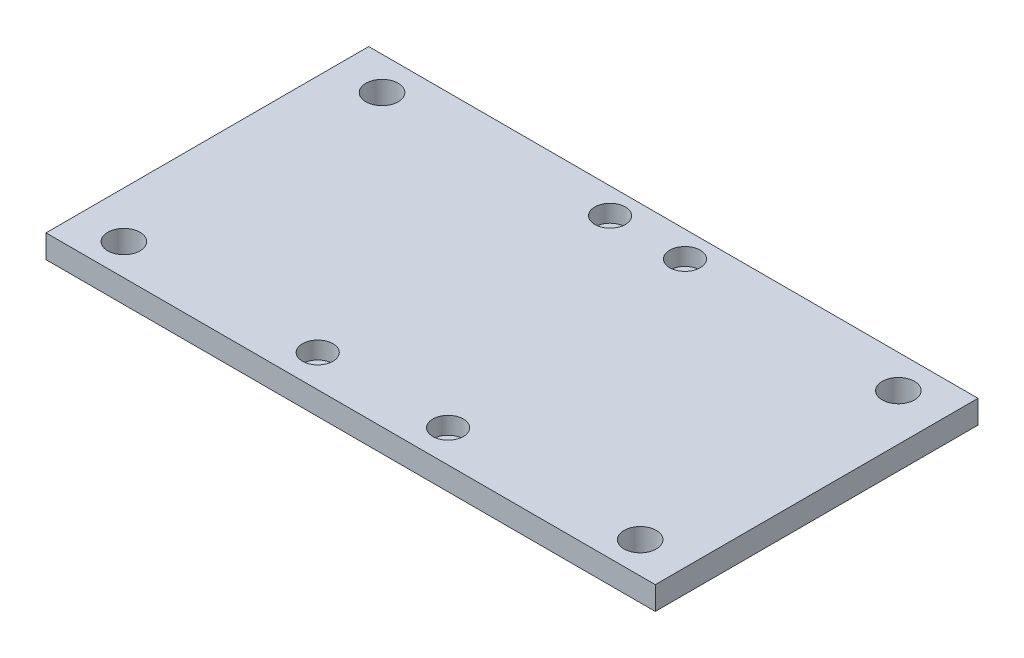
ISO-10303-21;
HEADER;
FILE_DESCRIPTION(('STEP AP214'),'2;1');
FILE_NAME('part.step','',(''),(''),'','','');
FILE_SCHEMA(('AUTOMOTIVE_DESIGN { 1 0 10303 214 1 1 1 1 }'));
ENDSEC;
DATA;
#1=APPLICATION_CONTEXT('core data for automotive mechanical design processes');
#2=APPLICATION_PROTOCOL_DEFINITION('international standard','automotive_design',2000,#1);
#3=PRODUCT_CONTEXT('',#1,'mechanical');
#4=PRODUCT('Part','Part','',(#3));
#5=PRODUCT_RELATED_PRODUCT_CATEGORY('part','',(#4));
#6=PRODUCT_DEFINITION_FORMATION('','',#4);
#7=PRODUCT_DEFINITION_CONTEXT('part definition',#1,'design');
#8=PRODUCT_DEFINITION('design','',#6,#7);
#9=PRODUCT_DEFINITION_SHAPE('','',#8);
#10=(LENGTH_UNIT() NAMED_UNIT(*) SI_UNIT(.MILLI.,.METRE.));
#11=(NAMED_UNIT(*) PLANE_ANGLE_UNIT() SI_UNIT($,.RADIAN.));
#12=(NAMED_UNIT(*) SI_UNIT($,.STERADIAN.) SOLID_ANGLE_UNIT());
#13=UNCERTAINTY_MEASURE_WITH_UNIT(LENGTH_MEASURE(1.E-05),#10,'distance_accuracy_value','');
#14=(GEOMETRIC_REPRESENTATION_CONTEXT(3) GLOBAL_UNCERTAINTY_ASSIGNED_CONTEXT((#13)) GLOBAL_UNIT_ASSIGNED_CONTEXT((#10,
#11,#12)) REPRESENTATION_CONTEXT('',''));
#15=CARTESIAN_POINT('',(0.,0.,0.));
#16=DIRECTION('',(0.,0.,1.));
#17=DIRECTION('',(1.,0.,0.));
#18=AXIS2_PLACEMENT_3D('',#15,#16,#17);
#19=CARTESIAN_POINT('',(-59.944,4.572,-31.75));
#20=DIRECTION('',(1.,0.,0.));
#21=DIRECTION('',(0.,0.,-1.));
#22=AXIS2_PLACEMENT_3D('',#19,#20,#21);
#23=PLANE('',#22);
#24=DIRECTION('',(0.,0.,1.));
#25=VECTOR('',#24,1.);
#26=CARTESIAN_POINT('',(-59.944,0.,-31.75));
#27=LINE('',#26,#25);
#28=CARTESIAN_POINT('',(-59.944,0.,-31.75));
#29=VERTEX_POINT('',#28);
#30=CARTESIAN_POINT('',(-59.944,0.,31.75));
#31=VERTEX_POINT('',#30);
#32=EDGE_CURVE('E107',#29,#31,#27,.T.);
#33=ORIENTED_EDGE('',*,*,#32,.T.);
#34=DIRECTION('',(0.,-1.,0.));
#35=VECTOR('',#34,1.);
#36=CARTESIAN_POINT('',(-59.944,4.572,31.75));
#37=LINE('',#36,#35);
#38=CARTESIAN_POINT('',(-59.944,4.572,31.75));
#39=VERTEX_POINT('',#38);
#40=EDGE_CURVE('E11',#39,#31,#37,.T.);
#41=ORIENTED_EDGE('',*,*,#40,.F.);
#42=DIRECTION('',(0.,0.,1.));
#43=VECTOR('',#42,1.);
#44=CARTESIAN_POINT('',(-59.944,4.572,-31.75));
#45=LINE('',#44,#43);
#46=CARTESIAN_POINT('',(-59.944,4.572,-31.75));
#47=VERTEX_POINT('',#46);
#48=EDGE_CURVE('E91',#47,#39,#45,.T.);
#49=ORIENTED_EDGE('',*,*,#48,.F.);
#50=DIRECTION('',(0.,-1.,0.));
#51=VECTOR('',#50,1.);
#52=CARTESIAN_POINT('',(-59.944,4.572,-31.75));
#53=LINE('',#52,#51);
#54=EDGE_CURVE('E103',#47,#29,#53,.T.);
#55=ORIENTED_EDGE('',*,*,#54,.T.);
#56=EDGE_LOOP('',(#33,#41,#49,#55));
#57=FACE_BOUND('',#56,.T.);
#58=ADVANCED_FACE('F39',(#57),#23,.F.);
#59=CARTESIAN_POINT('',(59.944,4.572,31.75));
#60=DIRECTION('',(0.,0.,-1.));
#61=DIRECTION('',(-1.,0.,0.));
#62=AXIS2_PLACEMENT_3D('',#59,#60,#61);
#63=PLANE('',#62);
#64=DIRECTION('',(1.,0.,0.));
#65=VECTOR('',#64,1.);
#66=CARTESIAN_POINT('',(59.944,0.,31.75));
#67=LINE('',#66,#65);
#68=CARTESIAN_POINT('',(59.944,0.,31.75));
#69=VERTEX_POINT('',#68);
#70=EDGE_CURVE('E96',#31,#69,#67,.T.);
#71=ORIENTED_EDGE('',*,*,#70,.T.);
#72=DIRECTION('',(0.,-1.,0.));
#73=VECTOR('',#72,1.);
#74=CARTESIAN_POINT('',(59.944,4.572,31.75));
#75=LINE('',#74,#73);
#76=CARTESIAN_POINT('',(59.944,4.572,31.75));
#77=VERTEX_POINT('',#76);
#78=EDGE_CURVE('E48',#77,#69,#75,.T.);
#79=ORIENTED_EDGE('',*,*,#78,.F.);
#80=DIRECTION('',(1.,0.,0.));
#81=VECTOR('',#80,1.);
#82=CARTESIAN_POINT('',(59.944,4.572,31.75));
#83=LINE('',#82,#81);
#84=EDGE_CURVE('E86',#39,#77,#83,.T.);
#85=ORIENTED_EDGE('',*,*,#84,.F.);
#86=ORIENTED_EDGE('',*,*,#40,.T.);
#87=EDGE_LOOP('',(#71,#79,#85,#86));
#88=FACE_BOUND('',#87,.T.);
#89=ADVANCED_FACE('F95',(#88),#63,.F.);
#90=CARTESIAN_POINT('',(59.944,4.572,-31.75));
#91=DIRECTION('',(-1.,0.,0.));
#92=DIRECTION('',(0.,0.,1.));
#93=AXIS2_PLACEMENT_3D('',#90,#91,#92);
#94=PLANE('',#93);
#95=DIRECTION('',(0.,0.,-1.));
#96=VECTOR('',#95,1.);
#97=CARTESIAN_POINT('',(59.944,0.,-31.75));
#98=LINE('',#97,#96);
#99=CARTESIAN_POINT('',(59.944,0.,-31.75));
#100=VERTEX_POINT('',#99);
#101=EDGE_CURVE('E73',#69,#100,#98,.T.);
#102=ORIENTED_EDGE('',*,*,#101,.T.);
#103=DIRECTION('',(0.,-1.,0.));
#104=VECTOR('',#103,1.);
#105=CARTESIAN_POINT('',(59.944,4.572,-31.75));
#106=LINE('',#105,#104);
#107=CARTESIAN_POINT('',(59.944,4.572,-31.75));
#108=VERTEX_POINT('',#107);
#109=EDGE_CURVE('E98',#108,#100,#106,.T.);
#110=ORIENTED_EDGE('',*,*,#109,.F.);
#111=DIRECTION('',(0.,0.,-1.));
#112=VECTOR('',#111,1.);
#113=CARTESIAN_POINT('',(59.944,4.572,-31.75));
#114=LINE('',#113,#112);
#115=EDGE_CURVE('E89',#77,#108,#114,.T.);
#116=ORIENTED_EDGE('',*,*,#115,.F.);
#117=ORIENTED_EDGE('',*,*,#78,.T.);
#118=EDGE_LOOP('',(#102,#110,#116,#117));
#119=FACE_BOUND('',#118,.T.);
#120=ADVANCED_FACE('F99',(#119),#94,.F.);
#121=CARTESIAN_POINT('',(59.944,4.572,-31.75));
#122=DIRECTION('',(0.,0.,1.));
#123=DIRECTION('',(1.,0.,0.));
#124=AXIS2_PLACEMENT_3D('',#121,#122,#123);
#125=PLANE('',#124);
#126=DIRECTION('',(-1.,0.,0.));
#127=VECTOR('',#126,1.);
#128=CARTESIAN_POINT('',(59.944,0.,-31.75));
#129=LINE('',#128,#127);
#130=EDGE_CURVE('E79',#100,#29,#129,.T.);
#131=ORIENTED_EDGE('',*,*,#130,.T.);
#132=ORIENTED_EDGE('',*,*,#54,.F.);
#133=DIRECTION('',(-1.,0.,0.));
#134=VECTOR('',#133,1.);
#135=CARTESIAN_POINT('',(59.944,4.572,-31.75));
#136=LINE('',#135,#134);
#137=EDGE_CURVE('E56',#108,#47,#136,.T.);
#138=ORIENTED_EDGE('',*,*,#137,.F.);
#139=ORIENTED_EDGE('',*,*,#109,.T.);
#140=EDGE_LOOP('',(#131,#132,#138,#139));
#141=FACE_BOUND('',#140,.T.);
#142=ADVANCED_FACE('F121',(#141),#125,.F.);
#143=CARTESIAN_POINT('',(0.,4.572,0.));
#144=DIRECTION('',(0.,-1.,0.));
#145=DIRECTION('',(0.,0.,-1.));
#146=AXIS2_PLACEMENT_3D('',#143,#144,#145);
#147=PLANE('',#146);
#148=CARTESIAN_POINT('',(50.8,4.572,25.5742866480706));
#149=DIRECTION('',(0.,1.,0.));
#150=DIRECTION('',(0.,0.,1.));
#151=AXIS2_PLACEMENT_3D('',#148,#149,#150);
#152=CIRCLE('',#151,3.175);
#153=CARTESIAN_POINT('',(50.8,4.572,28.7492866480706));
#154=VERTEX_POINT('',#153);
#155=EDGE_CURVE('E209',#154,#154,#152,.T.);
#156=ORIENTED_EDGE('',*,*,#155,.F.);
#157=EDGE_LOOP('',(#156));
#158=FACE_BOUND('',#157,.T.);
#159=CARTESIAN_POINT('',(-50.8,4.572,-25.2257133519294));
#160=DIRECTION('',(0.,1.,0.));
#161=DIRECTION('',(0.,0.,1.));
#162=AXIS2_PLACEMENT_3D('',#159,#160,#161);
#163=CIRCLE('',#162,3.175);
#164=CARTESIAN_POINT('',(-50.8,4.572,-22.0507133519294));
#165=VERTEX_POINT('',#164);
#166=EDGE_CURVE('E200',#165,#165,#163,.T.);
#167=ORIENTED_EDGE('',*,*,#166,.F.);
#168=EDGE_LOOP('',(#167));
#169=FACE_BOUND('',#168,.T.);
#170=CARTESIAN_POINT('',(-50.8,4.572,25.5742866480706));
#171=DIRECTION('',(0.,1.,0.));
#172=DIRECTION('',(0.,0.,1.));
#173=AXIS2_PLACEMENT_3D('',#170,#171,#172);
#174=CIRCLE('',#173,3.175);
#175=CARTESIAN_POINT('',(-50.8,4.572,28.7492866480706));
#176=VERTEX_POINT('',#175);
#177=EDGE_CURVE('E216',#176,#176,#174,.T.);
#178=ORIENTED_EDGE('',*,*,#177,.F.);
#179=EDGE_LOOP('',(#178));
#180=FACE_BOUND('',#179,.T.);
#181=CARTESIAN_POINT('',(50.8,4.572,-25.2257133519294));
#182=DIRECTION('',(0.,1.,0.));
#183=DIRECTION('',(0.,0.,1.));
#184=AXIS2_PLACEMENT_3D('',#181,#182,#183);
#185=CIRCLE('',#184,3.175);
#186=CARTESIAN_POINT('',(50.8,4.572,-22.0507133519294));
#187=VERTEX_POINT('',#186);
#188=EDGE_CURVE('E192',#187,#187,#185,.T.);
#189=ORIENTED_EDGE('',*,*,#188,.F.);
#190=EDGE_LOOP('',(#189));
#191=FACE_BOUND('',#190,.T.);
#192=CARTESIAN_POINT('',(7.366,4.572,-26.67));
#193=DIRECTION('',(0.,1.,0.));
#194=DIRECTION('',(0.,0.,1.));
#195=AXIS2_PLACEMENT_3D('',#192,#193,#194);
#196=CIRCLE('',#195,3.);
#197=CARTESIAN_POINT('',(7.366,4.572,-23.67));
#198=VERTEX_POINT('',#197);
#199=EDGE_CURVE('E187',#198,#198,#196,.T.);
#200=ORIENTED_EDGE('',*,*,#199,.F.);
#201=EDGE_LOOP('',(#200));
#202=FACE_BOUND('',#201,.T.);
#203=CARTESIAN_POINT('',(12.827,4.572,25.4));
#204=DIRECTION('',(0.,1.,0.));
#205=DIRECTION('',(0.,0.,1.));
#206=AXIS2_PLACEMENT_3D('',#203,#204,#205);
#207=CIRCLE('',#206,3.);
#208=CARTESIAN_POINT('',(12.827,4.572,28.4));
#209=VERTEX_POINT('',#208);
#210=EDGE_CURVE('E171',#209,#209,#207,.T.);
#211=ORIENTED_EDGE('',*,*,#210,.F.);
#212=EDGE_LOOP('',(#211));
#213=FACE_BOUND('',#212,.T.);
#214=CARTESIAN_POINT('',(-12.827,4.572,25.4));
#215=DIRECTION('',(0.,1.,0.));
#216=DIRECTION('',(0.,0.,1.));
#217=AXIS2_PLACEMENT_3D('',#214,#215,#216);
#218=CIRCLE('',#217,3.);
#219=CARTESIAN_POINT('',(-12.827,4.572,28.4));
#220=VERTEX_POINT('',#219);
#221=EDGE_CURVE('E155',#220,#220,#218,.T.);
#222=ORIENTED_EDGE('',*,*,#221,.F.);
#223=EDGE_LOOP('',(#222));
#224=FACE_BOUND('',#223,.T.);
#225=CARTESIAN_POINT('',(-7.36599999999999,4.572,-26.67));
#226=DIRECTION('',(0.,1.,0.));
#227=DIRECTION('',(0.,0.,1.));
#228=AXIS2_PLACEMENT_3D('',#225,#226,#227);
#229=CIRCLE('',#228,3.);
#230=CARTESIAN_POINT('',(-7.36599999999999,4.572,-23.67));
#231=VERTEX_POINT('',#230);
#232=EDGE_CURVE('E139',#231,#231,#229,.T.);
#233=ORIENTED_EDGE('',*,*,#232,.F.);
#234=EDGE_LOOP('',(#233));
#235=FACE_BOUND('',#234,.T.);
#236=ORIENTED_EDGE('',*,*,#48,.T.);
#237=ORIENTED_EDGE('',*,*,#84,.T.);
#238=ORIENTED_EDGE('',*,*,#115,.T.);
#239=ORIENTED_EDGE('',*,*,#137,.T.);
#240=EDGE_LOOP('',(#236,#237,#238,#239));
#241=FACE_BOUND('',#240,.T.);
#242=ADVANCED_FACE('F87',(#158,#169,#180,#191,#202,#213,#224,#235,#241),#147,.F.);
#243=CARTESIAN_POINT('',(0.,0.,0.));
#244=DIRECTION('',(0.,-1.,0.));
#245=DIRECTION('',(0.,0.,-1.));
#246=AXIS2_PLACEMENT_3D('',#243,#244,#245);
#247=PLANE('',#246);
#248=CARTESIAN_POINT('',(50.8,0.,25.5742866480706));
#249=DIRECTION('',(0.,1.,0.));
#250=DIRECTION('',(0.,0.,1.));
#251=AXIS2_PLACEMENT_3D('',#248,#249,#250);
#252=CIRCLE('',#251,3.175);
#253=CARTESIAN_POINT('',(50.8,0.,28.7492866480706));
#254=VERTEX_POINT('',#253);
#255=EDGE_CURVE('E196',#254,#254,#252,.T.);
#256=ORIENTED_EDGE('',*,*,#255,.T.);
#257=EDGE_LOOP('',(#256));
#258=FACE_BOUND('',#257,.T.);
#259=CARTESIAN_POINT('',(-50.8,0.,-25.2257133519294));
#260=DIRECTION('',(0.,1.,0.));
#261=DIRECTION('',(0.,0.,1.));
#262=AXIS2_PLACEMENT_3D('',#259,#260,#261);
#263=CIRCLE('',#262,3.175);
#264=CARTESIAN_POINT('',(-50.8,0.,-22.0507133519294));
#265=VERTEX_POINT('',#264);
#266=EDGE_CURVE('E204',#265,#265,#263,.T.);
#267=ORIENTED_EDGE('',*,*,#266,.T.);
#268=EDGE_LOOP('',(#267));
#269=FACE_BOUND('',#268,.T.);
#270=CARTESIAN_POINT('',(-50.8,0.,25.5742866480706));
#271=DIRECTION('',(0.,1.,0.));
#272=DIRECTION('',(0.,0.,1.));
#273=AXIS2_PLACEMENT_3D('',#270,#271,#272);
#274=CIRCLE('',#273,3.175);
#275=CARTESIAN_POINT('',(-50.8,0.,28.7492866480706));
#276=VERTEX_POINT('',#275);
#277=EDGE_CURVE('E205',#276,#276,#274,.T.);
#278=ORIENTED_EDGE('',*,*,#277,.T.);
#279=EDGE_LOOP('',(#278));
#280=FACE_BOUND('',#279,.T.);
#281=CARTESIAN_POINT('',(50.8,0.,-25.2257133519294));
#282=DIRECTION('',(0.,1.,0.));
#283=DIRECTION('',(0.,0.,1.));
#284=AXIS2_PLACEMENT_3D('',#281,#282,#283);
#285=CIRCLE('',#284,3.175);
#286=CARTESIAN_POINT('',(50.8,0.,-22.0507133519294));
#287=VERTEX_POINT('',#286);
#288=EDGE_CURVE('E191',#287,#287,#285,.T.);
#289=ORIENTED_EDGE('',*,*,#288,.T.);
#290=EDGE_LOOP('',(#289));
#291=FACE_BOUND('',#290,.T.);
#292=CARTESIAN_POINT('',(7.366,0.,-26.67));
#293=DIRECTION('',(0.,1.,0.));
#294=DIRECTION('',(0.,0.,1.));
#295=AXIS2_PLACEMENT_3D('',#292,#293,#294);
#296=CIRCLE('',#295,1.7);
#297=CARTESIAN_POINT('',(7.366,0.,-24.97));
#298=VERTEX_POINT('',#297);
#299=EDGE_CURVE('E175',#298,#298,#296,.T.);
#300=ORIENTED_EDGE('',*,*,#299,.T.);
#301=EDGE_LOOP('',(#300));
#302=FACE_BOUND('',#301,.T.);
#303=CARTESIAN_POINT('',(12.827,0.,25.4));
#304=DIRECTION('',(0.,1.,0.));
#305=DIRECTION('',(0.,0.,1.));
#306=AXIS2_PLACEMENT_3D('',#303,#304,#305);
#307=CIRCLE('',#306,1.7);
#308=CARTESIAN_POINT('',(12.827,0.,27.1));
#309=VERTEX_POINT('',#308);
#310=EDGE_CURVE('E159',#309,#309,#307,.T.);
#311=ORIENTED_EDGE('',*,*,#310,.T.);
#312=EDGE_LOOP('',(#311));
#313=FACE_BOUND('',#312,.T.);
#314=CARTESIAN_POINT('',(-12.827,0.,25.4));
#315=DIRECTION('',(0.,1.,0.));
#316=DIRECTION('',(0.,0.,1.));
#317=AXIS2_PLACEMENT_3D('',#314,#315,#316);
#318=CIRCLE('',#317,1.7);
#319=CARTESIAN_POINT('',(-12.827,0.,27.1));
#320=VERTEX_POINT('',#319);
#321=EDGE_CURVE('E143',#320,#320,#318,.T.);
#322=ORIENTED_EDGE('',*,*,#321,.T.);
#323=EDGE_LOOP('',(#322));
#324=FACE_BOUND('',#323,.T.);
#325=CARTESIAN_POINT('',(-7.36599999999999,0.,-26.67));
#326=DIRECTION('',(0.,1.,0.));
#327=DIRECTION('',(0.,0.,1.));
#328=AXIS2_PLACEMENT_3D('',#325,#326,#327);
#329=CIRCLE('',#328,1.7);
#330=CARTESIAN_POINT('',(-7.36599999999999,0.,-24.97));
#331=VERTEX_POINT('',#330);
#332=EDGE_CURVE('E111',#331,#331,#329,.T.);
#333=ORIENTED_EDGE('',*,*,#332,.T.);
#334=EDGE_LOOP('',(#333));
#335=FACE_BOUND('',#334,.T.);
#336=ORIENTED_EDGE('',*,*,#32,.F.);
#337=ORIENTED_EDGE('',*,*,#130,.F.);
#338=ORIENTED_EDGE('',*,*,#101,.F.);
#339=ORIENTED_EDGE('',*,*,#70,.F.);
#340=EDGE_LOOP('',(#336,#337,#338,#339));
#341=FACE_BOUND('',#340,.T.);
#342=ADVANCED_FACE('F124',(#258,#269,#280,#291,#302,#313,#324,#335,#341),#247,.T.);
#343=CARTESIAN_POINT('',(-7.36599999999999,4.572,-26.67));
#344=DIRECTION('',(0.,1.,0.));
#345=DIRECTION('',(0.,0.,1.));
#346=AXIS2_PLACEMENT_3D('',#343,#344,#345);
#347=CYLINDRICAL_SURFACE('',#346,1.7);
#348=ORIENTED_EDGE('',*,*,#332,.F.);
#349=EDGE_LOOP('',(#348));
#350=FACE_BOUND('',#349,.T.);
#351=CARTESIAN_POINT('',(-7.36599999999999,1.172,-26.67));
#352=DIRECTION('',(0.,1.,0.));
#353=DIRECTION('',(0.,0.,1.));
#354=AXIS2_PLACEMENT_3D('',#351,#352,#353);
#355=CIRCLE('',#354,1.7);
#356=CARTESIAN_POINT('',(-7.36599999999999,1.172,-24.97));
#357=VERTEX_POINT('',#356);
#358=EDGE_CURVE('E131',#357,#357,#355,.T.);
#359=ORIENTED_EDGE('',*,*,#358,.T.);
#360=EDGE_LOOP('',(#359));
#361=FACE_BOUND('',#360,.T.);
#362=ADVANCED_FACE('F261',(#350,#361),#347,.F.);
#363=CARTESIAN_POINT('',(-5.666,1.172,-26.67));
#364=DIRECTION('',(0.,-1.,0.));
#365=DIRECTION('',(0.,0.,-1.));
#366=AXIS2_PLACEMENT_3D('',#363,#364,#365);
#367=PLANE('',#366);
#368=ORIENTED_EDGE('',*,*,#358,.F.);
#369=EDGE_LOOP('',(#368));
#370=FACE_BOUND('',#369,.T.);
#371=CARTESIAN_POINT('',(-7.36599999999999,1.172,-26.67));
#372=DIRECTION('',(0.,1.,0.));
#373=DIRECTION('',(0.,0.,1.));
#374=AXIS2_PLACEMENT_3D('',#371,#372,#373);
#375=CIRCLE('',#374,3.);
#376=CARTESIAN_POINT('',(-7.36599999999999,1.172,-23.67));
#377=VERTEX_POINT('',#376);
#378=EDGE_CURVE('E135',#377,#377,#375,.T.);
#379=ORIENTED_EDGE('',*,*,#378,.T.);
#380=EDGE_LOOP('',(#379));
#381=FACE_BOUND('',#380,.T.);
#382=ADVANCED_FACE('F251',(#370,#381),#367,.F.);
#383=CARTESIAN_POINT('',(-7.36599999999999,4.572,-26.67));
#384=DIRECTION('',(0.,1.,0.));
#385=DIRECTION('',(0.,0.,1.));
#386=AXIS2_PLACEMENT_3D('',#383,#384,#385);
#387=CYLINDRICAL_SURFACE('',#386,3.);
#388=ORIENTED_EDGE('',*,*,#378,.F.);
#389=EDGE_LOOP('',(#388));
#390=FACE_BOUND('',#389,.T.);
#391=ORIENTED_EDGE('',*,*,#232,.T.);
#392=EDGE_LOOP('',(#391));
#393=FACE_BOUND('',#392,.T.);
#394=ADVANCED_FACE('F248',(#390,#393),#387,.F.);
#395=CARTESIAN_POINT('',(-12.827,4.572,25.4));
#396=DIRECTION('',(0.,1.,0.));
#397=DIRECTION('',(0.,0.,1.));
#398=AXIS2_PLACEMENT_3D('',#395,#396,#397);
#399=CYLINDRICAL_SURFACE('',#398,1.7);
#400=ORIENTED_EDGE('',*,*,#321,.F.);
#401=EDGE_LOOP('',(#400));
#402=FACE_BOUND('',#401,.T.);
#403=CARTESIAN_POINT('',(-12.827,1.172,25.4));
#404=DIRECTION('',(0.,1.,0.));
#405=DIRECTION('',(0.,0.,1.));
#406=AXIS2_PLACEMENT_3D('',#403,#404,#405);
#407=CIRCLE('',#406,1.7);
#408=CARTESIAN_POINT('',(-12.827,1.172,27.1));
#409=VERTEX_POINT('',#408);
#410=EDGE_CURVE('E147',#409,#409,#407,.T.);
#411=ORIENTED_EDGE('',*,*,#410,.T.);
#412=EDGE_LOOP('',(#411));
#413=FACE_BOUND('',#412,.T.);
#414=ADVANCED_FACE('F250',(#402,#413),#399,.F.);
#415=CARTESIAN_POINT('',(-11.127,1.172,25.4));
#416=DIRECTION('',(0.,-1.,0.));
#417=DIRECTION('',(0.,0.,-1.));
#418=AXIS2_PLACEMENT_3D('',#415,#416,#417);
#419=PLANE('',#418);
#420=ORIENTED_EDGE('',*,*,#410,.F.);
#421=EDGE_LOOP('',(#420));
#422=FACE_BOUND('',#421,.T.);
#423=CARTESIAN_POINT('',(-12.827,1.172,25.4));
#424=DIRECTION('',(0.,1.,0.));
#425=DIRECTION('',(0.,0.,1.));
#426=AXIS2_PLACEMENT_3D('',#423,#424,#425);
#427=CIRCLE('',#426,3.);
#428=CARTESIAN_POINT('',(-12.827,1.172,28.4));
#429=VERTEX_POINT('',#428);
#430=EDGE_CURVE('E151',#429,#429,#427,.T.);
#431=ORIENTED_EDGE('',*,*,#430,.T.);
#432=EDGE_LOOP('',(#431));
#433=FACE_BOUND('',#432,.T.);
#434=ADVANCED_FACE('F258',(#422,#433),#419,.F.);
#435=CARTESIAN_POINT('',(-12.827,4.572,25.4));
#436=DIRECTION('',(0.,1.,0.));
#437=DIRECTION('',(0.,0.,1.));
#438=AXIS2_PLACEMENT_3D('',#435,#436,#437);
#439=CYLINDRICAL_SURFACE('',#438,3.);
#440=ORIENTED_EDGE('',*,*,#430,.F.);
#441=EDGE_LOOP('',(#440));
#442=FACE_BOUND('',#441,.T.);
#443=ORIENTED_EDGE('',*,*,#221,.T.);
#444=EDGE_LOOP('',(#443));
#445=FACE_BOUND('',#444,.T.);
#446=ADVANCED_FACE('F314',(#442,#445),#439,.F.);
#447=CARTESIAN_POINT('',(12.827,4.572,25.4));
#448=DIRECTION('',(0.,1.,0.));
#449=DIRECTION('',(0.,0.,1.));
#450=AXIS2_PLACEMENT_3D('',#447,#448,#449);
#451=CYLINDRICAL_SURFACE('',#450,1.7);
#452=ORIENTED_EDGE('',*,*,#310,.F.);
#453=EDGE_LOOP('',(#452));
#454=FACE_BOUND('',#453,.T.);
#455=CARTESIAN_POINT('',(12.827,1.172,25.4));
#456=DIRECTION('',(0.,1.,0.));
#457=DIRECTION('',(0.,0.,1.));
#458=AXIS2_PLACEMENT_3D('',#455,#456,#457);
#459=CIRCLE('',#458,1.7);
#460=CARTESIAN_POINT('',(12.827,1.172,27.1));
#461=VERTEX_POINT('',#460);
#462=EDGE_CURVE('E163',#461,#461,#459,.T.);
#463=ORIENTED_EDGE('',*,*,#462,.T.);
#464=EDGE_LOOP('',(#463));
#465=FACE_BOUND('',#464,.T.);
#466=ADVANCED_FACE('F324',(#454,#465),#451,.F.);
#467=CARTESIAN_POINT('',(14.527,1.172,25.4));
#468=DIRECTION('',(0.,-1.,0.));
#469=DIRECTION('',(0.,0.,-1.));
#470=AXIS2_PLACEMENT_3D('',#467,#468,#469);
#471=PLANE('',#470);
#472=ORIENTED_EDGE('',*,*,#462,.F.);
#473=EDGE_LOOP('',(#472));
#474=FACE_BOUND('',#473,.T.);
#475=CARTESIAN_POINT('',(12.827,1.172,25.4));
#476=DIRECTION('',(0.,1.,0.));
#477=DIRECTION('',(0.,0.,1.));
#478=AXIS2_PLACEMENT_3D('',#475,#476,#477);
#479=CIRCLE('',#478,3.);
#480=CARTESIAN_POINT('',(12.827,1.172,28.4));
#481=VERTEX_POINT('',#480);
#482=EDGE_CURVE('E167',#481,#481,#479,.T.);
#483=ORIENTED_EDGE('',*,*,#482,.T.);
#484=EDGE_LOOP('',(#483));
#485=FACE_BOUND('',#484,.T.);
#486=ADVANCED_FACE('F334',(#474,#485),#471,.F.);
#487=CARTESIAN_POINT('',(12.827,4.572,25.4));
#488=DIRECTION('',(0.,1.,0.));
#489=DIRECTION('',(0.,0.,1.));
#490=AXIS2_PLACEMENT_3D('',#487,#488,#489);
#491=CYLINDRICAL_SURFACE('',#490,3.);
#492=ORIENTED_EDGE('',*,*,#482,.F.);
#493=EDGE_LOOP('',(#492));
#494=FACE_BOUND('',#493,.T.);
#495=ORIENTED_EDGE('',*,*,#210,.T.);
#496=EDGE_LOOP('',(#495));
#497=FACE_BOUND('',#496,.T.);
#498=ADVANCED_FACE('F344',(#494,#497),#491,.F.);
#499=CARTESIAN_POINT('',(7.366,4.572,-26.67));
#500=DIRECTION('',(0.,1.,0.));
#501=DIRECTION('',(0.,0.,1.));
#502=AXIS2_PLACEMENT_3D('',#499,#500,#501);
#503=CYLINDRICAL_SURFACE('',#502,1.7);
#504=ORIENTED_EDGE('',*,*,#299,.F.);
#505=EDGE_LOOP('',(#504));
#506=FACE_BOUND('',#505,.T.);
#507=CARTESIAN_POINT('',(7.366,1.172,-26.67));
#508=DIRECTION('',(0.,1.,0.));
#509=DIRECTION('',(0.,0.,1.));
#510=AXIS2_PLACEMENT_3D('',#507,#508,#509);
#511=CIRCLE('',#510,1.7);
#512=CARTESIAN_POINT('',(7.366,1.172,-24.97));
#513=VERTEX_POINT('',#512);
#514=EDGE_CURVE('E179',#513,#513,#511,.T.);
#515=ORIENTED_EDGE('',*,*,#514,.T.);
#516=EDGE_LOOP('',(#515));
#517=FACE_BOUND('',#516,.T.);
#518=ADVANCED_FACE('F354',(#506,#517),#503,.F.);
#519=CARTESIAN_POINT('',(9.066,1.172,-26.67));
#520=DIRECTION('',(0.,-1.,0.));
#521=DIRECTION('',(0.,0.,-1.));
#522=AXIS2_PLACEMENT_3D('',#519,#520,#521);
#523=PLANE('',#522);
#524=ORIENTED_EDGE('',*,*,#514,.F.);
#525=EDGE_LOOP('',(#524));
#526=FACE_BOUND('',#525,.T.);
#527=CARTESIAN_POINT('',(7.366,1.172,-26.67));
#528=DIRECTION('',(0.,1.,0.));
#529=DIRECTION('',(0.,0.,1.));
#530=AXIS2_PLACEMENT_3D('',#527,#528,#529);
#531=CIRCLE('',#530,3.);
#532=CARTESIAN_POINT('',(7.366,1.172,-23.67));
#533=VERTEX_POINT('',#532);
#534=EDGE_CURVE('E183',#533,#533,#531,.T.);
#535=ORIENTED_EDGE('',*,*,#534,.T.);
#536=EDGE_LOOP('',(#535));
#537=FACE_BOUND('',#536,.T.);
#538=ADVANCED_FACE('F364',(#526,#537),#523,.F.);
#539=CARTESIAN_POINT('',(7.366,4.572,-26.67));
#540=DIRECTION('',(0.,1.,0.));
#541=DIRECTION('',(0.,0.,1.));
#542=AXIS2_PLACEMENT_3D('',#539,#540,#541);
#543=CYLINDRICAL_SURFACE('',#542,3.);
#544=ORIENTED_EDGE('',*,*,#534,.F.);
#545=EDGE_LOOP('',(#544));
#546=FACE_BOUND('',#545,.T.);
#547=ORIENTED_EDGE('',*,*,#199,.T.);
#548=EDGE_LOOP('',(#547));
#549=FACE_BOUND('',#548,.T.);
#550=ADVANCED_FACE('F374',(#546,#549),#543,.F.);
#551=CARTESIAN_POINT('',(50.8,0.,-25.2257133519294));
#552=DIRECTION('',(0.,1.,0.));
#553=DIRECTION('',(0.,0.,1.));
#554=AXIS2_PLACEMENT_3D('',#551,#552,#553);
#555=CYLINDRICAL_SURFACE('',#554,3.175);
#556=ORIENTED_EDGE('',*,*,#288,.F.);
#557=EDGE_LOOP('',(#556));
#558=FACE_BOUND('',#557,.T.);
#559=ORIENTED_EDGE('',*,*,#188,.T.);
#560=EDGE_LOOP('',(#559));
#561=FACE_BOUND('',#560,.T.);
#562=ADVANCED_FACE('F230',(#558,#561),#555,.F.);
#563=CARTESIAN_POINT('',(-50.8,0.,25.5742866480706));
#564=DIRECTION('',(0.,1.,0.));
#565=DIRECTION('',(0.,0.,1.));
#566=AXIS2_PLACEMENT_3D('',#563,#564,#565);
#567=CYLINDRICAL_SURFACE('',#566,3.175);
#568=ORIENTED_EDGE('',*,*,#277,.F.);
#569=EDGE_LOOP('',(#568));
#570=FACE_BOUND('',#569,.T.);
#571=ORIENTED_EDGE('',*,*,#177,.T.);
#572=EDGE_LOOP('',(#571));
#573=FACE_BOUND('',#572,.T.);
#574=ADVANCED_FACE('F226',(#570,#573),#567,.F.);
#575=CARTESIAN_POINT('',(-50.8,0.,-25.2257133519294));
#576=DIRECTION('',(0.,1.,0.));
#577=DIRECTION('',(0.,0.,1.));
#578=AXIS2_PLACEMENT_3D('',#575,#576,#577);
#579=CYLINDRICAL_SURFACE('',#578,3.175);
#580=ORIENTED_EDGE('',*,*,#266,.F.);
#581=EDGE_LOOP('',(#580));
#582=FACE_BOUND('',#581,.T.);
#583=ORIENTED_EDGE('',*,*,#166,.T.);
#584=EDGE_LOOP('',(#583));
#585=FACE_BOUND('',#584,.T.);
#586=ADVANCED_FACE('F229',(#582,#585),#579,.F.);
#587=CARTESIAN_POINT('',(50.8,0.,25.5742866480706));
#588=DIRECTION('',(0.,1.,0.));
#589=DIRECTION('',(0.,0.,1.));
#590=AXIS2_PLACEMENT_3D('',#587,#588,#589);
#591=CYLINDRICAL_SURFACE('',#590,3.175);
#592=ORIENTED_EDGE('',*,*,#255,.F.);
#593=EDGE_LOOP('',(#592));
#594=FACE_BOUND('',#593,.T.);
#595=ORIENTED_EDGE('',*,*,#155,.T.);
#596=EDGE_LOOP('',(#595));
#597=FACE_BOUND('',#596,.T.);
#598=ADVANCED_FACE('F419',(#594,#597),#591,.F.);
#599=CLOSED_SHELL('',(#58,#89,#120,#142,#242,#342,#362,#382,#394,#414,#434,#446,#466,#486,#498,
#518,#538,#550,#562,#574,#586,#598));
#600=MANIFOLD_SOLID_BREP('B2',#599);
#601=ADVANCED_BREP_SHAPE_REPRESENTATION('',(#18,#600),#14);
#602=SHAPE_DEFINITION_REPRESENTATION(#9,#601);
ENDSEC;
END-ISO-10303-21;
